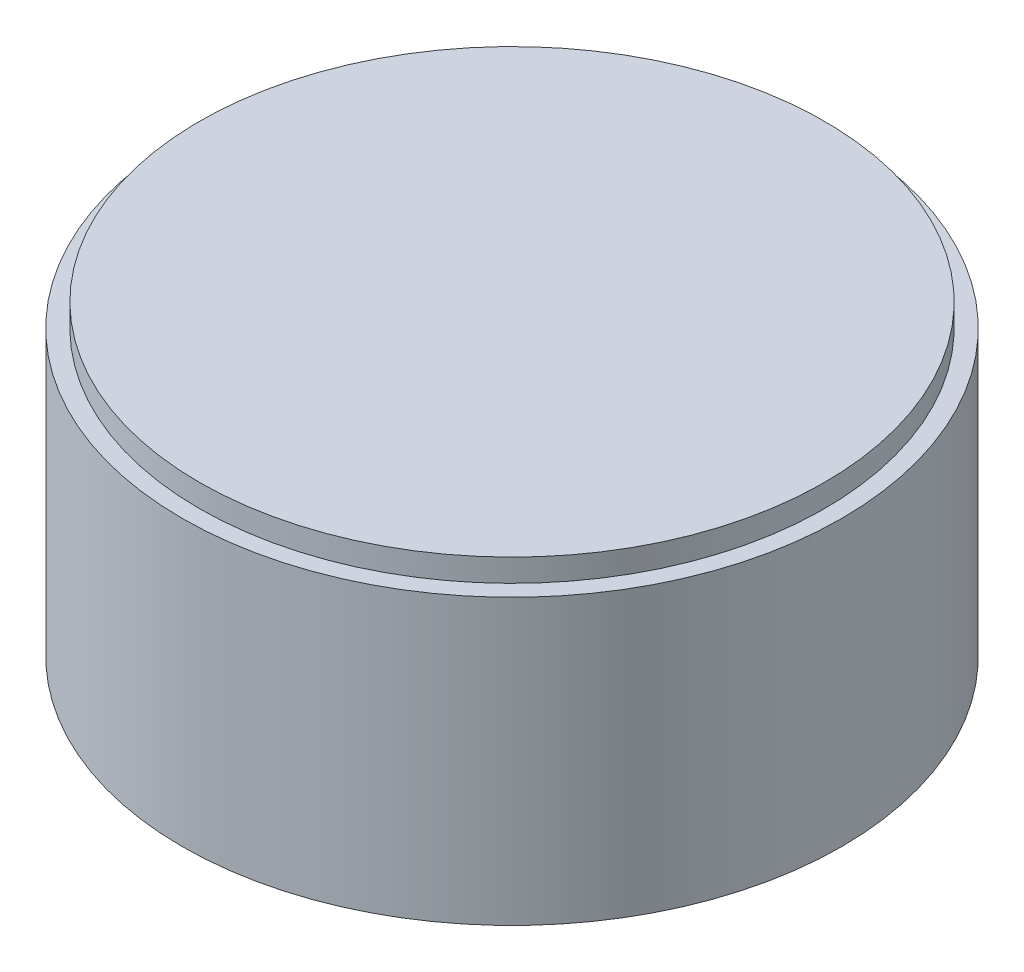
ISO-10303-21;
HEADER;
FILE_DESCRIPTION(('STEP AP214'),'2;1');
FILE_NAME('part.step','',(''),(''),'','','');
FILE_SCHEMA(('AUTOMOTIVE_DESIGN { 1 0 10303 214 1 1 1 1 }'));
ENDSEC;
DATA;
#1=APPLICATION_CONTEXT('core data for automotive mechanical design processes');
#2=APPLICATION_PROTOCOL_DEFINITION('international standard','automotive_design',2000,#1);
#3=PRODUCT_CONTEXT('',#1,'mechanical');
#4=PRODUCT('Part','Part','',(#3));
#5=PRODUCT_RELATED_PRODUCT_CATEGORY('part','',(#4));
#6=PRODUCT_DEFINITION_FORMATION('','',#4);
#7=PRODUCT_DEFINITION_CONTEXT('part definition',#1,'design');
#8=PRODUCT_DEFINITION('design','',#6,#7);
#9=PRODUCT_DEFINITION_SHAPE('','',#8);
#10=(LENGTH_UNIT() NAMED_UNIT(*) SI_UNIT(.MILLI.,.METRE.));
#11=(NAMED_UNIT(*) PLANE_ANGLE_UNIT() SI_UNIT($,.RADIAN.));
#12=(NAMED_UNIT(*) SI_UNIT($,.STERADIAN.) SOLID_ANGLE_UNIT());
#13=UNCERTAINTY_MEASURE_WITH_UNIT(LENGTH_MEASURE(1.E-05),#10,'distance_accuracy_value','');
#14=(GEOMETRIC_REPRESENTATION_CONTEXT(3) GLOBAL_UNCERTAINTY_ASSIGNED_CONTEXT((#13)) GLOBAL_UNIT_ASSIGNED_CONTEXT((#10,
#11,#12)) REPRESENTATION_CONTEXT('',''));
#15=CARTESIAN_POINT('',(0.,0.,0.));
#16=DIRECTION('',(0.,0.,1.));
#17=DIRECTION('',(1.,0.,0.));
#18=AXIS2_PLACEMENT_3D('',#15,#16,#17);
#19=CARTESIAN_POINT('',(0.,5.,0.));
#20=DIRECTION('',(0.,1.,0.));
#21=DIRECTION('',(0.,0.,1.));
#22=AXIS2_PLACEMENT_3D('',#19,#20,#21);
#23=PLANE('',#22);
#24=CARTESIAN_POINT('',(0.,5.,0.));
#25=DIRECTION('',(0.,1.,0.));
#26=DIRECTION('',(0.,0.,1.));
#27=AXIS2_PLACEMENT_3D('',#24,#25,#26);
#28=CIRCLE('',#27,5.8);
#29=CARTESIAN_POINT('',(0.,5.,5.8));
#30=VERTEX_POINT('',#29);
#31=EDGE_CURVE('E10',#30,#30,#28,.T.);
#32=ORIENTED_EDGE('',*,*,#31,.T.);
#33=EDGE_LOOP('',(#32));
#34=FACE_BOUND('',#33,.T.);
#35=CARTESIAN_POINT('',(0.,5.,0.));
#36=DIRECTION('',(0.,1.,0.));
#37=DIRECTION('',(0.,0.,1.));
#38=AXIS2_PLACEMENT_3D('',#35,#36,#37);
#39=CIRCLE('',#38,5.5);
#40=CARTESIAN_POINT('',(0.,5.,5.5));
#41=VERTEX_POINT('',#40);
#42=EDGE_CURVE('E44',#41,#41,#39,.T.);
#43=ORIENTED_EDGE('',*,*,#42,.F.);
#44=EDGE_LOOP('',(#43));
#45=FACE_BOUND('',#44,.T.);
#46=ADVANCED_FACE('F31',(#34,#45),#23,.T.);
#47=CARTESIAN_POINT('',(0.,5.,0.));
#48=DIRECTION('',(0.,-1.,0.));
#49=DIRECTION('',(0.,0.,-1.));
#50=AXIS2_PLACEMENT_3D('',#47,#48,#49);
#51=CYLINDRICAL_SURFACE('',#50,5.8);
#52=ORIENTED_EDGE('',*,*,#31,.F.);
#53=EDGE_LOOP('',(#52));
#54=FACE_BOUND('',#53,.T.);
#55=CARTESIAN_POINT('',(0.,0.,0.));
#56=DIRECTION('',(0.,1.,0.));
#57=DIRECTION('',(0.,0.,1.));
#58=AXIS2_PLACEMENT_3D('',#55,#56,#57);
#59=CIRCLE('',#58,5.8);
#60=CARTESIAN_POINT('',(0.,0.,5.8));
#61=VERTEX_POINT('',#60);
#62=EDGE_CURVE('E35',#61,#61,#59,.T.);
#63=ORIENTED_EDGE('',*,*,#62,.T.);
#64=EDGE_LOOP('',(#63));
#65=FACE_BOUND('',#64,.T.);
#66=ADVANCED_FACE('F33',(#54,#65),#51,.T.);
#67=CARTESIAN_POINT('',(0.,0.,0.));
#68=DIRECTION('',(0.,1.,0.));
#69=DIRECTION('',(0.,0.,1.));
#70=AXIS2_PLACEMENT_3D('',#67,#68,#69);
#71=PLANE('',#70);
#72=ORIENTED_EDGE('',*,*,#62,.F.);
#73=EDGE_LOOP('',(#72));
#74=FACE_BOUND('',#73,.T.);
#75=ADVANCED_FACE('F55',(#74),#71,.F.);
#76=CARTESIAN_POINT('',(0.,5.4,0.));
#77=DIRECTION('',(0.,-1.,0.));
#78=DIRECTION('',(0.,0.,-1.));
#79=AXIS2_PLACEMENT_3D('',#76,#77,#78);
#80=CYLINDRICAL_SURFACE('',#79,5.5);
#81=CARTESIAN_POINT('',(0.,5.4,0.));
#82=DIRECTION('',(0.,1.,0.));
#83=DIRECTION('',(0.,0.,1.));
#84=AXIS2_PLACEMENT_3D('',#81,#82,#83);
#85=CIRCLE('',#84,5.5);
#86=CARTESIAN_POINT('',(0.,5.4,5.5));
#87=VERTEX_POINT('',#86);
#88=EDGE_CURVE('E42',#87,#87,#85,.T.);
#89=ORIENTED_EDGE('',*,*,#88,.F.);
#90=EDGE_LOOP('',(#89));
#91=FACE_BOUND('',#90,.T.);
#92=ORIENTED_EDGE('',*,*,#42,.T.);
#93=EDGE_LOOP('',(#92));
#94=FACE_BOUND('',#93,.T.);
#95=ADVANCED_FACE('F52',(#91,#94),#80,.T.);
#96=CARTESIAN_POINT('',(0.,5.4,0.));
#97=DIRECTION('',(0.,1.,0.));
#98=DIRECTION('',(0.,0.,1.));
#99=AXIS2_PLACEMENT_3D('',#96,#97,#98);
#100=PLANE('',#99);
#101=ORIENTED_EDGE('',*,*,#88,.T.);
#102=EDGE_LOOP('',(#101));
#103=FACE_BOUND('',#102,.T.);
#104=ADVANCED_FACE('F50',(#103),#100,.T.);
#105=CLOSED_SHELL('',(#46,#66,#75,#95,#104));
#106=MANIFOLD_SOLID_BREP('B2',#105);
#107=ADVANCED_BREP_SHAPE_REPRESENTATION('',(#18,#106),#14);
#108=SHAPE_DEFINITION_REPRESENTATION(#9,#107);
ENDSEC;
END-ISO-10303-21;
